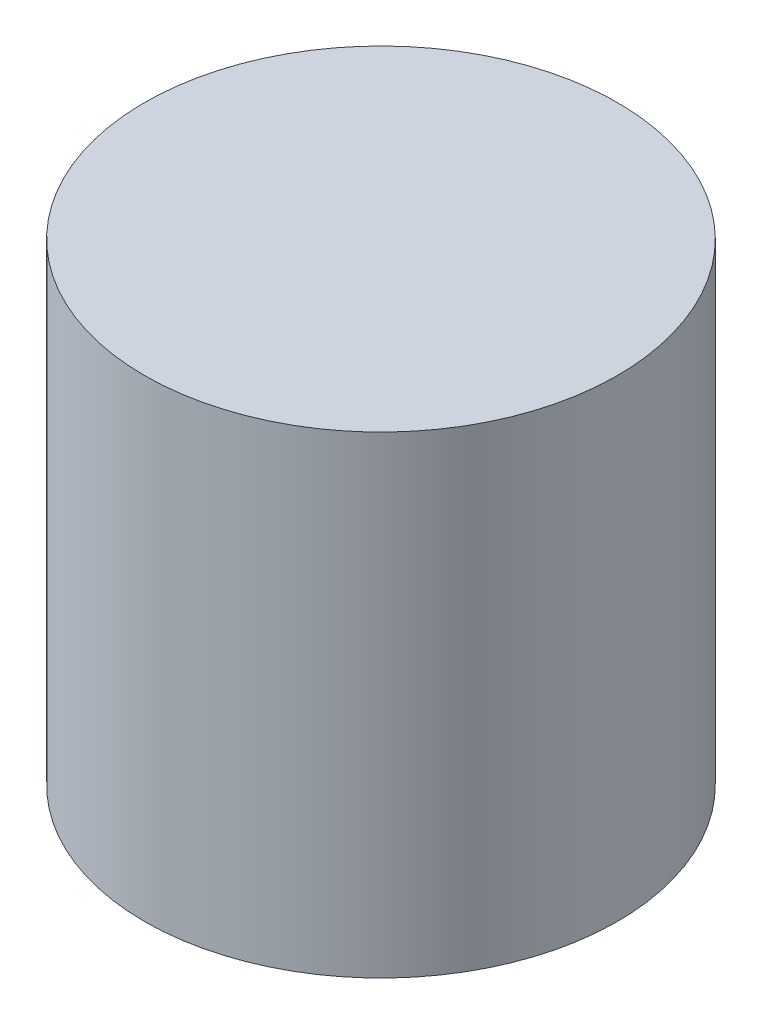
ISO-10303-21;
HEADER;
FILE_DESCRIPTION(('STEP AP214'),'2;1');
FILE_NAME('part.step','',(''),(''),'','','');
FILE_SCHEMA(('AUTOMOTIVE_DESIGN { 1 0 10303 214 1 1 1 1 }'));
ENDSEC;
DATA;
#1=APPLICATION_CONTEXT('core data for automotive mechanical design processes');
#2=APPLICATION_PROTOCOL_DEFINITION('international standard','automotive_design',2000,#1);
#3=PRODUCT_CONTEXT('',#1,'mechanical');
#4=PRODUCT('Part','Part','',(#3));
#5=PRODUCT_RELATED_PRODUCT_CATEGORY('part','',(#4));
#6=PRODUCT_DEFINITION_FORMATION('','',#4);
#7=PRODUCT_DEFINITION_CONTEXT('part definition',#1,'design');
#8=PRODUCT_DEFINITION('design','',#6,#7);
#9=PRODUCT_DEFINITION_SHAPE('','',#8);
#10=(LENGTH_UNIT() NAMED_UNIT(*) SI_UNIT(.MILLI.,.METRE.));
#11=(NAMED_UNIT(*) PLANE_ANGLE_UNIT() SI_UNIT($,.RADIAN.));
#12=(NAMED_UNIT(*) SI_UNIT($,.STERADIAN.) SOLID_ANGLE_UNIT());
#13=UNCERTAINTY_MEASURE_WITH_UNIT(LENGTH_MEASURE(1.E-05),#10,'distance_accuracy_value','');
#14=(GEOMETRIC_REPRESENTATION_CONTEXT(3) GLOBAL_UNCERTAINTY_ASSIGNED_CONTEXT((#13)) GLOBAL_UNIT_ASSIGNED_CONTEXT((#10,
#11,#12)) REPRESENTATION_CONTEXT('',''));
#15=CARTESIAN_POINT('',(0.,0.,0.));
#16=DIRECTION('',(0.,0.,1.));
#17=DIRECTION('',(1.,0.,0.));
#18=AXIS2_PLACEMENT_3D('',#15,#16,#17);
#19=CARTESIAN_POINT('',(-59.7493669753483,127.,-21.0515904369103));
#20=DIRECTION('',(0.,-1.,0.));
#21=DIRECTION('',(0.,0.,-1.));
#22=AXIS2_PLACEMENT_3D('',#19,#20,#21);
#23=CYLINDRICAL_SURFACE('',#22,63.5);
#24=CARTESIAN_POINT('',(-59.7493669753483,127.,-21.0515904369103));
#25=DIRECTION('',(0.,1.,0.));
#26=DIRECTION('',(0.,0.,1.));
#27=AXIS2_PLACEMENT_3D('',#24,#25,#26);
#28=CIRCLE('',#27,63.5);
#29=CARTESIAN_POINT('',(-59.7493669753483,127.,42.4484095630897));
#30=VERTEX_POINT('',#29);
#31=EDGE_CURVE('E10',#30,#30,#28,.T.);
#32=ORIENTED_EDGE('',*,*,#31,.F.);
#33=EDGE_LOOP('',(#32));
#34=FACE_BOUND('',#33,.T.);
#35=CARTESIAN_POINT('',(-59.7493669753483,0.,-21.0515904369103));
#36=DIRECTION('',(0.,1.,0.));
#37=DIRECTION('',(0.,0.,1.));
#38=AXIS2_PLACEMENT_3D('',#35,#36,#37);
#39=CIRCLE('',#38,63.5);
#40=CARTESIAN_POINT('',(-59.7493669753483,0.,42.4484095630897));
#41=VERTEX_POINT('',#40);
#42=EDGE_CURVE('E40',#41,#41,#39,.T.);
#43=ORIENTED_EDGE('',*,*,#42,.T.);
#44=EDGE_LOOP('',(#43));
#45=FACE_BOUND('',#44,.T.);
#46=ADVANCED_FACE('F37',(#34,#45),#23,.T.);
#47=CARTESIAN_POINT('',(-59.7493669753483,127.,-21.0515904369103));
#48=DIRECTION('',(0.,1.,0.));
#49=DIRECTION('',(0.,0.,1.));
#50=AXIS2_PLACEMENT_3D('',#47,#48,#49);
#51=PLANE('',#50);
#52=ORIENTED_EDGE('',*,*,#31,.T.);
#53=EDGE_LOOP('',(#52));
#54=FACE_BOUND('',#53,.T.);
#55=ADVANCED_FACE('F54',(#54),#51,.T.);
#56=CARTESIAN_POINT('',(-59.7493669753483,0.,-21.0515904369103));
#57=DIRECTION('',(0.,1.,0.));
#58=DIRECTION('',(0.,0.,1.));
#59=AXIS2_PLACEMENT_3D('',#56,#57,#58);
#60=PLANE('',#59);
#61=ORIENTED_EDGE('',*,*,#42,.F.);
#62=EDGE_LOOP('',(#61));
#63=FACE_BOUND('',#62,.T.);
#64=ADVANCED_FACE('F52',(#63),#60,.F.);
#65=CLOSED_SHELL('',(#46,#55,#64));
#66=MANIFOLD_SOLID_BREP('B2',#65);
#67=ADVANCED_BREP_SHAPE_REPRESENTATION('',(#18,#66),#14);
#68=SHAPE_DEFINITION_REPRESENTATION(#9,#67);
ENDSEC;
END-ISO-10303-21;
